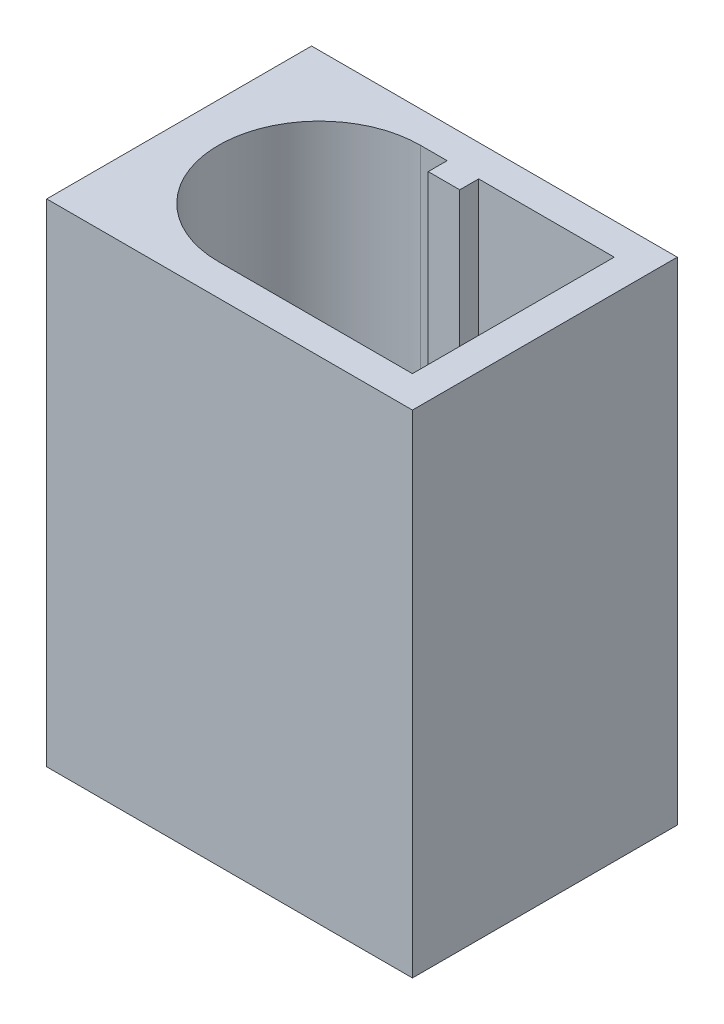
ISO-10303-21;
HEADER;
FILE_DESCRIPTION(('STEP AP214'),'2;1');
FILE_NAME('part.step','',(''),(''),'','','');
FILE_SCHEMA(('AUTOMOTIVE_DESIGN { 1 0 10303 214 1 1 1 1 }'));
ENDSEC;
DATA;
#1=APPLICATION_CONTEXT('core data for automotive mechanical design processes');
#2=APPLICATION_PROTOCOL_DEFINITION('international standard','automotive_design',2000,#1);
#3=PRODUCT_CONTEXT('',#1,'mechanical');
#4=PRODUCT('Part','Part','',(#3));
#5=PRODUCT_RELATED_PRODUCT_CATEGORY('part','',(#4));
#6=PRODUCT_DEFINITION_FORMATION('','',#4);
#7=PRODUCT_DEFINITION_CONTEXT('part definition',#1,'design');
#8=PRODUCT_DEFINITION('design','',#6,#7);
#9=PRODUCT_DEFINITION_SHAPE('','',#8);
#10=(LENGTH_UNIT() NAMED_UNIT(*) SI_UNIT(.MILLI.,.METRE.));
#11=(NAMED_UNIT(*) PLANE_ANGLE_UNIT() SI_UNIT($,.RADIAN.));
#12=(NAMED_UNIT(*) SI_UNIT($,.STERADIAN.) SOLID_ANGLE_UNIT());
#13=UNCERTAINTY_MEASURE_WITH_UNIT(LENGTH_MEASURE(1.E-05),#10,'distance_accuracy_value','');
#14=(GEOMETRIC_REPRESENTATION_CONTEXT(3) GLOBAL_UNCERTAINTY_ASSIGNED_CONTEXT((#13)) GLOBAL_UNIT_ASSIGNED_CONTEXT((#10,
#11,#12)) REPRESENTATION_CONTEXT('',''));
#15=CARTESIAN_POINT('',(0.,0.,0.));
#16=DIRECTION('',(0.,0.,1.));
#17=DIRECTION('',(1.,0.,0.));
#18=AXIS2_PLACEMENT_3D('',#15,#16,#17);
#19=CARTESIAN_POINT('',(0.,7.8,0.));
#20=DIRECTION('',(1.,0.,0.));
#21=DIRECTION('',(0.,0.,-1.));
#22=AXIS2_PLACEMENT_3D('',#19,#20,#21);
#23=PLANE('',#22);
#24=DIRECTION('',(0.,0.,1.));
#25=VECTOR('',#24,1.);
#26=CARTESIAN_POINT('',(0.,0.,0.));
#27=LINE('',#26,#25);
#28=CARTESIAN_POINT('',(0.,0.,-4.2));
#29=VERTEX_POINT('',#28);
#30=CARTESIAN_POINT('',(0.,0.,0.));
#31=VERTEX_POINT('',#30);
#32=EDGE_CURVE('E200',#29,#31,#27,.T.);
#33=ORIENTED_EDGE('',*,*,#32,.T.);
#34=DIRECTION('',(0.,-1.,0.));
#35=VECTOR('',#34,1.);
#36=CARTESIAN_POINT('',(0.,7.8,0.));
#37=LINE('',#36,#35);
#38=CARTESIAN_POINT('',(0.,7.8,0.));
#39=VERTEX_POINT('',#38);
#40=EDGE_CURVE('E11',#39,#31,#37,.T.);
#41=ORIENTED_EDGE('',*,*,#40,.F.);
#42=DIRECTION('',(0.,0.,1.));
#43=VECTOR('',#42,1.);
#44=CARTESIAN_POINT('',(0.,7.8,0.));
#45=LINE('',#44,#43);
#46=CARTESIAN_POINT('',(0.,7.8,-4.2));
#47=VERTEX_POINT('',#46);
#48=EDGE_CURVE('E216',#47,#39,#45,.T.);
#49=ORIENTED_EDGE('',*,*,#48,.F.);
#50=DIRECTION('',(0.,-1.,0.));
#51=VECTOR('',#50,1.);
#52=CARTESIAN_POINT('',(0.,7.8,-4.2));
#53=LINE('',#52,#51);
#54=EDGE_CURVE('E223',#47,#29,#53,.T.);
#55=ORIENTED_EDGE('',*,*,#54,.T.);
#56=EDGE_LOOP('',(#33,#41,#49,#55));
#57=FACE_BOUND('',#56,.T.);
#58=ADVANCED_FACE('F41',(#57),#23,.F.);
#59=CARTESIAN_POINT('',(0.,7.8,0.));
#60=DIRECTION('',(0.,0.,-1.));
#61=DIRECTION('',(-1.,0.,0.));
#62=AXIS2_PLACEMENT_3D('',#59,#60,#61);
#63=PLANE('',#62);
#64=DIRECTION('',(1.,0.,0.));
#65=VECTOR('',#64,1.);
#66=CARTESIAN_POINT('',(0.,0.,0.));
#67=LINE('',#66,#65);
#68=CARTESIAN_POINT('',(5.8,0.,0.));
#69=VERTEX_POINT('',#68);
#70=EDGE_CURVE('E226',#31,#69,#67,.T.);
#71=ORIENTED_EDGE('',*,*,#70,.T.);
#72=DIRECTION('',(0.,-1.,0.));
#73=VECTOR('',#72,1.);
#74=CARTESIAN_POINT('',(5.8,7.8,0.));
#75=LINE('',#74,#73);
#76=CARTESIAN_POINT('',(5.8,7.8,0.));
#77=VERTEX_POINT('',#76);
#78=EDGE_CURVE('E48',#77,#69,#75,.T.);
#79=ORIENTED_EDGE('',*,*,#78,.F.);
#80=DIRECTION('',(1.,0.,0.));
#81=VECTOR('',#80,1.);
#82=CARTESIAN_POINT('',(0.,7.8,0.));
#83=LINE('',#82,#81);
#84=EDGE_CURVE('E92',#39,#77,#83,.T.);
#85=ORIENTED_EDGE('',*,*,#84,.F.);
#86=ORIENTED_EDGE('',*,*,#40,.T.);
#87=EDGE_LOOP('',(#71,#79,#85,#86));
#88=FACE_BOUND('',#87,.T.);
#89=ADVANCED_FACE('F256',(#88),#63,.F.);
#90=CARTESIAN_POINT('',(5.8,7.8,0.));
#91=DIRECTION('',(-1.,0.,0.));
#92=DIRECTION('',(0.,0.,1.));
#93=AXIS2_PLACEMENT_3D('',#90,#91,#92);
#94=PLANE('',#93);
#95=DIRECTION('',(0.,0.,-1.));
#96=VECTOR('',#95,1.);
#97=CARTESIAN_POINT('',(5.8,0.,0.));
#98=LINE('',#97,#96);
#99=CARTESIAN_POINT('',(5.8,0.,-4.2));
#100=VERTEX_POINT('',#99);
#101=EDGE_CURVE('E228',#69,#100,#98,.T.);
#102=ORIENTED_EDGE('',*,*,#101,.T.);
#103=DIRECTION('',(0.,-1.,0.));
#104=VECTOR('',#103,1.);
#105=CARTESIAN_POINT('',(5.8,7.8,-4.2));
#106=LINE('',#105,#104);
#107=CARTESIAN_POINT('',(5.8,7.8,-4.2));
#108=VERTEX_POINT('',#107);
#109=EDGE_CURVE('E233',#108,#100,#106,.T.);
#110=ORIENTED_EDGE('',*,*,#109,.F.);
#111=DIRECTION('',(0.,0.,-1.));
#112=VECTOR('',#111,1.);
#113=CARTESIAN_POINT('',(5.8,7.8,0.));
#114=LINE('',#113,#112);
#115=EDGE_CURVE('E220',#77,#108,#114,.T.);
#116=ORIENTED_EDGE('',*,*,#115,.F.);
#117=ORIENTED_EDGE('',*,*,#78,.T.);
#118=EDGE_LOOP('',(#102,#110,#116,#117));
#119=FACE_BOUND('',#118,.T.);
#120=ADVANCED_FACE('F238',(#119),#94,.F.);
#121=CARTESIAN_POINT('',(0.,7.8,-4.2));
#122=DIRECTION('',(0.,0.,1.));
#123=DIRECTION('',(1.,0.,0.));
#124=AXIS2_PLACEMENT_3D('',#121,#122,#123);
#125=PLANE('',#124);
#126=DIRECTION('',(-1.,0.,0.));
#127=VECTOR('',#126,1.);
#128=CARTESIAN_POINT('',(0.,0.,-4.2));
#129=LINE('',#128,#127);
#130=EDGE_CURVE('E85',#100,#29,#129,.T.);
#131=ORIENTED_EDGE('',*,*,#130,.T.);
#132=ORIENTED_EDGE('',*,*,#54,.F.);
#133=DIRECTION('',(-1.,0.,0.));
#134=VECTOR('',#133,1.);
#135=CARTESIAN_POINT('',(0.,7.8,-4.2));
#136=LINE('',#135,#134);
#137=EDGE_CURVE('E64',#108,#47,#136,.T.);
#138=ORIENTED_EDGE('',*,*,#137,.F.);
#139=ORIENTED_EDGE('',*,*,#109,.T.);
#140=EDGE_LOOP('',(#131,#132,#138,#139));
#141=FACE_BOUND('',#140,.T.);
#142=ADVANCED_FACE('F246',(#141),#125,.F.);
#143=CARTESIAN_POINT('',(0.,7.8,0.));
#144=DIRECTION('',(0.,-1.,0.));
#145=DIRECTION('',(0.,0.,-1.));
#146=AXIS2_PLACEMENT_3D('',#143,#144,#145);
#147=PLANE('',#146);
#148=DIRECTION('',(1.,0.,0.));
#149=VECTOR('',#148,1.);
#150=CARTESIAN_POINT('',(2.225,7.8,-0.5));
#151=LINE('',#150,#149);
#152=CARTESIAN_POINT('',(2.225,7.8,-0.5));
#153=VERTEX_POINT('',#152);
#154=CARTESIAN_POINT('',(5.3,7.8,-0.5));
#155=VERTEX_POINT('',#154);
#156=EDGE_CURVE('E182',#153,#155,#151,.T.);
#157=ORIENTED_EDGE('',*,*,#156,.F.);
#158=CARTESIAN_POINT('',(2.225,7.8,-2.1));
#159=DIRECTION('',(0.,1.,0.));
#160=DIRECTION('',(0.,0.,1.));
#161=AXIS2_PLACEMENT_3D('',#158,#159,#160);
#162=CIRCLE('',#161,1.6);
#163=CARTESIAN_POINT('',(2.225,7.8,-3.7));
#164=VERTEX_POINT('',#163);
#165=EDGE_CURVE('E55',#164,#153,#162,.T.);
#166=ORIENTED_EDGE('',*,*,#165,.F.);
#167=DIRECTION('',(-1.,0.,0.));
#168=VECTOR('',#167,1.);
#169=CARTESIAN_POINT('',(2.65,7.8,-3.7));
#170=LINE('',#169,#168);
#171=CARTESIAN_POINT('',(2.65,7.8,-3.7));
#172=VERTEX_POINT('',#171);
#173=EDGE_CURVE('E160',#172,#164,#170,.T.);
#174=ORIENTED_EDGE('',*,*,#173,.F.);
#175=DIRECTION('',(0.,0.,-1.));
#176=VECTOR('',#175,1.);
#177=CARTESIAN_POINT('',(2.65,7.8,-3.4));
#178=LINE('',#177,#176);
#179=CARTESIAN_POINT('',(2.65,7.8,-3.4));
#180=VERTEX_POINT('',#179);
#181=EDGE_CURVE('E163',#180,#172,#178,.T.);
#182=ORIENTED_EDGE('',*,*,#181,.F.);
#183=DIRECTION('',(-1.,0.,0.));
#184=VECTOR('',#183,1.);
#185=CARTESIAN_POINT('',(3.15,7.8,-3.4));
#186=LINE('',#185,#184);
#187=CARTESIAN_POINT('',(3.15,7.8,-3.4));
#188=VERTEX_POINT('',#187);
#189=EDGE_CURVE('E193',#188,#180,#186,.T.);
#190=ORIENTED_EDGE('',*,*,#189,.F.);
#191=DIRECTION('',(0.,0.,1.));
#192=VECTOR('',#191,1.);
#193=CARTESIAN_POINT('',(3.15,7.8,-3.7));
#194=LINE('',#193,#192);
#195=CARTESIAN_POINT('',(3.15,7.8,-3.7));
#196=VERTEX_POINT('',#195);
#197=EDGE_CURVE('E190',#196,#188,#194,.T.);
#198=ORIENTED_EDGE('',*,*,#197,.F.);
#199=DIRECTION('',(-1.,0.,0.));
#200=VECTOR('',#199,1.);
#201=CARTESIAN_POINT('',(5.3,7.8,-3.7));
#202=LINE('',#201,#200);
#203=CARTESIAN_POINT('',(5.3,7.8,-3.7));
#204=VERTEX_POINT('',#203);
#205=EDGE_CURVE('E187',#204,#196,#202,.T.);
#206=ORIENTED_EDGE('',*,*,#205,.F.);
#207=DIRECTION('',(0.,0.,-1.));
#208=VECTOR('',#207,1.);
#209=CARTESIAN_POINT('',(5.3,7.8,-0.5));
#210=LINE('',#209,#208);
#211=EDGE_CURVE('E184',#155,#204,#210,.T.);
#212=ORIENTED_EDGE('',*,*,#211,.F.);
#213=EDGE_LOOP('',(#157,#166,#174,#182,#190,#198,#206,#212));
#214=FACE_BOUND('',#213,.T.);
#215=ORIENTED_EDGE('',*,*,#48,.T.);
#216=ORIENTED_EDGE('',*,*,#84,.T.);
#217=ORIENTED_EDGE('',*,*,#115,.T.);
#218=ORIENTED_EDGE('',*,*,#137,.T.);
#219=EDGE_LOOP('',(#215,#216,#217,#218));
#220=FACE_BOUND('',#219,.T.);
#221=ADVANCED_FACE('F248',(#214,#220),#147,.F.);
#222=CARTESIAN_POINT('',(0.,0.,0.));
#223=DIRECTION('',(0.,-1.,0.));
#224=DIRECTION('',(0.,0.,-1.));
#225=AXIS2_PLACEMENT_3D('',#222,#223,#224);
#226=PLANE('',#225);
#227=ORIENTED_EDGE('',*,*,#32,.F.);
#228=ORIENTED_EDGE('',*,*,#130,.F.);
#229=ORIENTED_EDGE('',*,*,#101,.F.);
#230=ORIENTED_EDGE('',*,*,#70,.F.);
#231=EDGE_LOOP('',(#227,#228,#229,#230));
#232=FACE_BOUND('',#231,.T.);
#233=ADVANCED_FACE('F242',(#232),#226,.T.);
#234=CARTESIAN_POINT('',(2.225,0.799999999999999,-2.1));
#235=DIRECTION('',(0.,1.,0.));
#236=DIRECTION('',(0.,0.,1.));
#237=AXIS2_PLACEMENT_3D('',#234,#235,#236);
#238=CYLINDRICAL_SURFACE('',#237,1.6);
#239=ORIENTED_EDGE('',*,*,#165,.T.);
#240=DIRECTION('',(0.,1.,0.));
#241=VECTOR('',#240,1.);
#242=CARTESIAN_POINT('',(2.225,0.799999999999999,-0.5));
#243=LINE('',#242,#241);
#244=CARTESIAN_POINT('',(2.225,0.799999999999999,-0.5));
#245=VERTEX_POINT('',#244);
#246=EDGE_CURVE('E137',#245,#153,#243,.T.);
#247=ORIENTED_EDGE('',*,*,#246,.F.);
#248=CARTESIAN_POINT('',(2.225,0.799999999999999,-2.1));
#249=DIRECTION('',(0.,1.,0.));
#250=DIRECTION('',(0.,0.,1.));
#251=AXIS2_PLACEMENT_3D('',#248,#249,#250);
#252=CIRCLE('',#251,1.6);
#253=CARTESIAN_POINT('',(2.225,0.799999999999999,-3.7));
#254=VERTEX_POINT('',#253);
#255=EDGE_CURVE('E141',#254,#245,#252,.T.);
#256=ORIENTED_EDGE('',*,*,#255,.F.);
#257=DIRECTION('',(0.,1.,0.));
#258=VECTOR('',#257,1.);
#259=CARTESIAN_POINT('',(2.225,0.799999999999999,-3.7));
#260=LINE('',#259,#258);
#261=EDGE_CURVE('E198',#254,#164,#260,.T.);
#262=ORIENTED_EDGE('',*,*,#261,.T.);
#263=EDGE_LOOP('',(#239,#247,#256,#262));
#264=FACE_BOUND('',#263,.T.);
#265=ADVANCED_FACE('F139',(#264),#238,.F.);
#266=CARTESIAN_POINT('',(2.65,0.799999999999999,-3.7));
#267=DIRECTION('',(0.,0.,-1.));
#268=DIRECTION('',(-1.,0.,0.));
#269=AXIS2_PLACEMENT_3D('',#266,#267,#268);
#270=PLANE('',#269);
#271=ORIENTED_EDGE('',*,*,#173,.T.);
#272=ORIENTED_EDGE('',*,*,#261,.F.);
#273=DIRECTION('',(-1.,0.,0.));
#274=VECTOR('',#273,1.);
#275=CARTESIAN_POINT('',(2.65,0.799999999999999,-3.7));
#276=LINE('',#275,#274);
#277=CARTESIAN_POINT('',(2.65,0.799999999999999,-3.7));
#278=VERTEX_POINT('',#277);
#279=EDGE_CURVE('E147',#278,#254,#276,.T.);
#280=ORIENTED_EDGE('',*,*,#279,.F.);
#281=DIRECTION('',(0.,1.,0.));
#282=VECTOR('',#281,1.);
#283=CARTESIAN_POINT('',(2.65,0.799999999999999,-3.7));
#284=LINE('',#283,#282);
#285=EDGE_CURVE('E201',#278,#172,#284,.T.);
#286=ORIENTED_EDGE('',*,*,#285,.T.);
#287=EDGE_LOOP('',(#271,#272,#280,#286));
#288=FACE_BOUND('',#287,.T.);
#289=ADVANCED_FACE('F299',(#288),#270,.F.);
#290=CARTESIAN_POINT('',(2.65,0.799999999999999,-3.4));
#291=DIRECTION('',(1.,0.,0.));
#292=DIRECTION('',(0.,0.,-1.));
#293=AXIS2_PLACEMENT_3D('',#290,#291,#292);
#294=PLANE('',#293);
#295=ORIENTED_EDGE('',*,*,#181,.T.);
#296=ORIENTED_EDGE('',*,*,#285,.F.);
#297=DIRECTION('',(0.,0.,-1.));
#298=VECTOR('',#297,1.);
#299=CARTESIAN_POINT('',(2.65,0.799999999999999,-3.4));
#300=LINE('',#299,#298);
#301=CARTESIAN_POINT('',(2.65,0.799999999999999,-3.4));
#302=VERTEX_POINT('',#301);
#303=EDGE_CURVE('E178',#302,#278,#300,.T.);
#304=ORIENTED_EDGE('',*,*,#303,.F.);
#305=DIRECTION('',(0.,1.,0.));
#306=VECTOR('',#305,1.);
#307=CARTESIAN_POINT('',(2.65,0.799999999999999,-3.4));
#308=LINE('',#307,#306);
#309=EDGE_CURVE('E204',#302,#180,#308,.T.);
#310=ORIENTED_EDGE('',*,*,#309,.T.);
#311=EDGE_LOOP('',(#295,#296,#304,#310));
#312=FACE_BOUND('',#311,.T.);
#313=ADVANCED_FACE('F308',(#312),#294,.F.);
#314=CARTESIAN_POINT('',(3.15,0.799999999999999,-3.4));
#315=DIRECTION('',(0.,0.,-1.));
#316=DIRECTION('',(-1.,0.,0.));
#317=AXIS2_PLACEMENT_3D('',#314,#315,#316);
#318=PLANE('',#317);
#319=ORIENTED_EDGE('',*,*,#189,.T.);
#320=ORIENTED_EDGE('',*,*,#309,.F.);
#321=DIRECTION('',(-1.,0.,0.));
#322=VECTOR('',#321,1.);
#323=CARTESIAN_POINT('',(3.15,0.799999999999999,-3.4));
#324=LINE('',#323,#322);
#325=CARTESIAN_POINT('',(3.15,0.799999999999999,-3.4));
#326=VERTEX_POINT('',#325);
#327=EDGE_CURVE('E175',#326,#302,#324,.T.);
#328=ORIENTED_EDGE('',*,*,#327,.F.);
#329=DIRECTION('',(0.,1.,0.));
#330=VECTOR('',#329,1.);
#331=CARTESIAN_POINT('',(3.15,0.799999999999999,-3.4));
#332=LINE('',#331,#330);
#333=EDGE_CURVE('E207',#326,#188,#332,.T.);
#334=ORIENTED_EDGE('',*,*,#333,.T.);
#335=EDGE_LOOP('',(#319,#320,#328,#334));
#336=FACE_BOUND('',#335,.T.);
#337=ADVANCED_FACE('F318',(#336),#318,.F.);
#338=CARTESIAN_POINT('',(3.15,0.799999999999999,-3.7));
#339=DIRECTION('',(-1.,0.,0.));
#340=DIRECTION('',(0.,0.,1.));
#341=AXIS2_PLACEMENT_3D('',#338,#339,#340);
#342=PLANE('',#341);
#343=ORIENTED_EDGE('',*,*,#197,.T.);
#344=ORIENTED_EDGE('',*,*,#333,.F.);
#345=DIRECTION('',(0.,0.,1.));
#346=VECTOR('',#345,1.);
#347=CARTESIAN_POINT('',(3.15,0.799999999999999,-3.7));
#348=LINE('',#347,#346);
#349=CARTESIAN_POINT('',(3.15,0.799999999999999,-3.7));
#350=VERTEX_POINT('',#349);
#351=EDGE_CURVE('E171',#350,#326,#348,.T.);
#352=ORIENTED_EDGE('',*,*,#351,.F.);
#353=DIRECTION('',(0.,1.,0.));
#354=VECTOR('',#353,1.);
#355=CARTESIAN_POINT('',(3.15,0.799999999999999,-3.7));
#356=LINE('',#355,#354);
#357=EDGE_CURVE('E210',#350,#196,#356,.T.);
#358=ORIENTED_EDGE('',*,*,#357,.T.);
#359=EDGE_LOOP('',(#343,#344,#352,#358));
#360=FACE_BOUND('',#359,.T.);
#361=ADVANCED_FACE('F328',(#360),#342,.F.);
#362=CARTESIAN_POINT('',(5.3,0.799999999999999,-3.7));
#363=DIRECTION('',(0.,0.,-1.));
#364=DIRECTION('',(-1.,0.,0.));
#365=AXIS2_PLACEMENT_3D('',#362,#363,#364);
#366=PLANE('',#365);
#367=ORIENTED_EDGE('',*,*,#205,.T.);
#368=ORIENTED_EDGE('',*,*,#357,.F.);
#369=DIRECTION('',(-1.,0.,0.));
#370=VECTOR('',#369,1.);
#371=CARTESIAN_POINT('',(5.3,0.799999999999999,-3.7));
#372=LINE('',#371,#370);
#373=CARTESIAN_POINT('',(5.3,0.799999999999999,-3.7));
#374=VERTEX_POINT('',#373);
#375=EDGE_CURVE('E167',#374,#350,#372,.T.);
#376=ORIENTED_EDGE('',*,*,#375,.F.);
#377=DIRECTION('',(0.,1.,0.));
#378=VECTOR('',#377,1.);
#379=CARTESIAN_POINT('',(5.3,0.799999999999999,-3.7));
#380=LINE('',#379,#378);
#381=EDGE_CURVE('E213',#374,#204,#380,.T.);
#382=ORIENTED_EDGE('',*,*,#381,.T.);
#383=EDGE_LOOP('',(#367,#368,#376,#382));
#384=FACE_BOUND('',#383,.T.);
#385=ADVANCED_FACE('F337',(#384),#366,.F.);
#386=CARTESIAN_POINT('',(5.3,0.799999999999999,-0.5));
#387=DIRECTION('',(1.,0.,0.));
#388=DIRECTION('',(0.,0.,-1.));
#389=AXIS2_PLACEMENT_3D('',#386,#387,#388);
#390=PLANE('',#389);
#391=ORIENTED_EDGE('',*,*,#211,.T.);
#392=ORIENTED_EDGE('',*,*,#381,.F.);
#393=DIRECTION('',(0.,0.,-1.));
#394=VECTOR('',#393,1.);
#395=CARTESIAN_POINT('',(5.3,0.799999999999999,-0.5));
#396=LINE('',#395,#394);
#397=CARTESIAN_POINT('',(5.3,0.799999999999999,-0.5));
#398=VERTEX_POINT('',#397);
#399=EDGE_CURVE('E155',#398,#374,#396,.T.);
#400=ORIENTED_EDGE('',*,*,#399,.F.);
#401=DIRECTION('',(0.,1.,0.));
#402=VECTOR('',#401,1.);
#403=CARTESIAN_POINT('',(5.3,0.799999999999999,-0.5));
#404=LINE('',#403,#402);
#405=EDGE_CURVE('E146',#398,#155,#404,.T.);
#406=ORIENTED_EDGE('',*,*,#405,.T.);
#407=EDGE_LOOP('',(#391,#392,#400,#406));
#408=FACE_BOUND('',#407,.T.);
#409=ADVANCED_FACE('F347',(#408),#390,.F.);
#410=CARTESIAN_POINT('',(2.225,0.799999999999999,-0.5));
#411=DIRECTION('',(0.,0.,1.));
#412=DIRECTION('',(1.,0.,0.));
#413=AXIS2_PLACEMENT_3D('',#410,#411,#412);
#414=PLANE('',#413);
#415=ORIENTED_EDGE('',*,*,#156,.T.);
#416=ORIENTED_EDGE('',*,*,#405,.F.);
#417=DIRECTION('',(1.,0.,0.));
#418=VECTOR('',#417,1.);
#419=CARTESIAN_POINT('',(2.225,0.799999999999999,-0.5));
#420=LINE('',#419,#418);
#421=EDGE_CURVE('E150',#245,#398,#420,.T.);
#422=ORIENTED_EDGE('',*,*,#421,.F.);
#423=ORIENTED_EDGE('',*,*,#246,.T.);
#424=EDGE_LOOP('',(#415,#416,#422,#423));
#425=FACE_BOUND('',#424,.T.);
#426=ADVANCED_FACE('F151',(#425),#414,.F.);
#427=CARTESIAN_POINT('',(2.225,0.799999999999999,-2.1));
#428=DIRECTION('',(0.,1.,0.));
#429=DIRECTION('',(0.,0.,1.));
#430=AXIS2_PLACEMENT_3D('',#427,#428,#429);
#431=PLANE('',#430);
#432=ORIENTED_EDGE('',*,*,#255,.T.);
#433=ORIENTED_EDGE('',*,*,#421,.T.);
#434=ORIENTED_EDGE('',*,*,#399,.T.);
#435=ORIENTED_EDGE('',*,*,#375,.T.);
#436=ORIENTED_EDGE('',*,*,#351,.T.);
#437=ORIENTED_EDGE('',*,*,#327,.T.);
#438=ORIENTED_EDGE('',*,*,#303,.T.);
#439=ORIENTED_EDGE('',*,*,#279,.T.);
#440=EDGE_LOOP('',(#432,#433,#434,#435,#436,#437,#438,#439));
#441=FACE_BOUND('',#440,.T.);
#442=ADVANCED_FACE('F157',(#441),#431,.T.);
#443=CLOSED_SHELL('',(#58,#89,#120,#142,#221,#233,#265,#289,#313,#337,#361,#385,#409,#426,#442));
#444=MANIFOLD_SOLID_BREP('B2',#443);
#445=ADVANCED_BREP_SHAPE_REPRESENTATION('',(#18,#444),#14);
#446=SHAPE_DEFINITION_REPRESENTATION(#9,#445);
ENDSEC;
END-ISO-10303-21;
